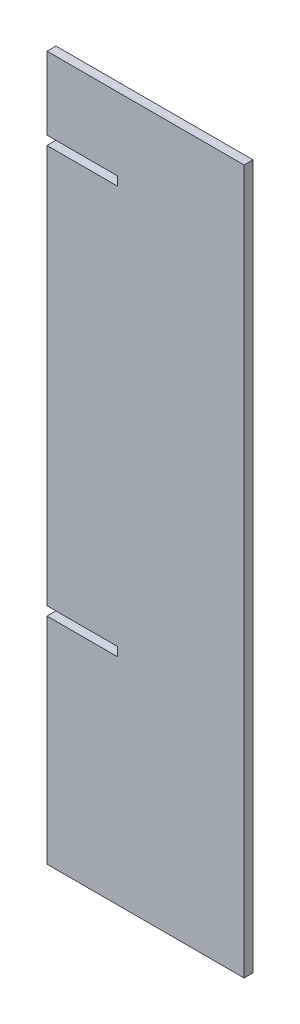
ISO-10303-21;
HEADER;
FILE_DESCRIPTION(('STEP AP214'),'2;1');
FILE_NAME('part.step','',(''),(''),'','','');
FILE_SCHEMA(('AUTOMOTIVE_DESIGN { 1 0 10303 214 1 1 1 1 }'));
ENDSEC;
DATA;
#1=APPLICATION_CONTEXT('core data for automotive mechanical design processes');
#2=APPLICATION_PROTOCOL_DEFINITION('international standard','automotive_design',2000,#1);
#3=PRODUCT_CONTEXT('',#1,'mechanical');
#4=PRODUCT('Part','Part','',(#3));
#5=PRODUCT_RELATED_PRODUCT_CATEGORY('part','',(#4));
#6=PRODUCT_DEFINITION_FORMATION('','',#4);
#7=PRODUCT_DEFINITION_CONTEXT('part definition',#1,'design');
#8=PRODUCT_DEFINITION('design','',#6,#7);
#9=PRODUCT_DEFINITION_SHAPE('','',#8);
#10=(LENGTH_UNIT() NAMED_UNIT(*) SI_UNIT(.MILLI.,.METRE.));
#11=(NAMED_UNIT(*) PLANE_ANGLE_UNIT() SI_UNIT($,.RADIAN.));
#12=(NAMED_UNIT(*) SI_UNIT($,.STERADIAN.) SOLID_ANGLE_UNIT());
#13=UNCERTAINTY_MEASURE_WITH_UNIT(LENGTH_MEASURE(1.E-05),#10,'distance_accuracy_value','');
#14=(GEOMETRIC_REPRESENTATION_CONTEXT(3) GLOBAL_UNCERTAINTY_ASSIGNED_CONTEXT((#13)) GLOBAL_UNIT_ASSIGNED_CONTEXT((#10,
#11,#12)) REPRESENTATION_CONTEXT('',''));
#15=CARTESIAN_POINT('',(0.,0.,0.));
#16=DIRECTION('',(0.,0.,1.));
#17=DIRECTION('',(1.,0.,0.));
#18=AXIS2_PLACEMENT_3D('',#15,#16,#17);
#19=CARTESIAN_POINT('',(-35.,125.,3.175));
#20=DIRECTION('',(1.,0.,0.));
#21=DIRECTION('',(0.,1.,0.));
#22=AXIS2_PLACEMENT_3D('',#19,#20,#21);
#23=PLANE('',#22);
#24=DIRECTION('',(0.,-1.,0.));
#25=VECTOR('',#24,1.);
#26=CARTESIAN_POINT('',(-35.,125.,0.));
#27=LINE('',#26,#25);
#28=CARTESIAN_POINT('',(-35.,125.,0.));
#29=VERTEX_POINT('',#28);
#30=CARTESIAN_POINT('',(-35.,99.18,0.));
#31=VERTEX_POINT('',#30);
#32=EDGE_CURVE('E152',#29,#31,#27,.T.);
#33=ORIENTED_EDGE('',*,*,#32,.T.);
#34=DIRECTION('',(0.,0.,1.));
#35=VECTOR('',#34,1.);
#36=CARTESIAN_POINT('',(-35.,99.18,0.));
#37=LINE('',#36,#35);
#38=CARTESIAN_POINT('',(-35.,99.18,3.175));
#39=VERTEX_POINT('',#38);
#40=EDGE_CURVE('E192',#31,#39,#37,.T.);
#41=ORIENTED_EDGE('',*,*,#40,.T.);
#42=DIRECTION('',(0.,-1.,0.));
#43=VECTOR('',#42,1.);
#44=CARTESIAN_POINT('',(-35.,125.,3.175));
#45=LINE('',#44,#43);
#46=CARTESIAN_POINT('',(-35.,125.,3.175));
#47=VERTEX_POINT('',#46);
#48=EDGE_CURVE('E176',#47,#39,#45,.T.);
#49=ORIENTED_EDGE('',*,*,#48,.F.);
#50=DIRECTION('',(0.,0.,-1.));
#51=VECTOR('',#50,1.);
#52=CARTESIAN_POINT('',(-35.,125.,3.175));
#53=LINE('',#52,#51);
#54=EDGE_CURVE('E47',#47,#29,#53,.T.);
#55=ORIENTED_EDGE('',*,*,#54,.T.);
#56=EDGE_LOOP('',(#33,#41,#49,#55));
#57=FACE_BOUND('',#56,.T.);
#58=ADVANCED_FACE('F39',(#57),#23,.F.);
#59=CARTESIAN_POINT('',(-35.,96.005,3.175));
#60=VERTEX_POINT('',#59);
#61=CARTESIAN_POINT('',(-35.,-45.52,3.175));
#62=VERTEX_POINT('',#61);
#63=EDGE_CURVE('E145',#60,#62,#45,.T.);
#64=ORIENTED_EDGE('',*,*,#63,.F.);
#65=DIRECTION('',(0.,0.,1.));
#66=VECTOR('',#65,1.);
#67=CARTESIAN_POINT('',(-35.,96.005,0.));
#68=LINE('',#67,#66);
#69=CARTESIAN_POINT('',(-35.,96.005,0.));
#70=VERTEX_POINT('',#69);
#71=EDGE_CURVE('E131',#70,#60,#68,.T.);
#72=ORIENTED_EDGE('',*,*,#71,.F.);
#73=CARTESIAN_POINT('',(-35.,-45.52,0.));
#74=VERTEX_POINT('',#73);
#75=EDGE_CURVE('E143',#70,#74,#27,.T.);
#76=ORIENTED_EDGE('',*,*,#75,.T.);
#77=DIRECTION('',(0.,0.,1.));
#78=VECTOR('',#77,1.);
#79=CARTESIAN_POINT('',(-35.,-45.52,0.));
#80=LINE('',#79,#78);
#81=EDGE_CURVE('E204',#74,#62,#80,.T.);
#82=ORIENTED_EDGE('',*,*,#81,.T.);
#83=EDGE_LOOP('',(#64,#72,#76,#82));
#84=FACE_BOUND('',#83,.T.);
#85=ADVANCED_FACE('F141',(#84),#23,.F.);
#86=CARTESIAN_POINT('',(35.,125.,3.175));
#87=DIRECTION('',(-1.,0.,0.));
#88=DIRECTION('',(0.,-1.,0.));
#89=AXIS2_PLACEMENT_3D('',#86,#87,#88);
#90=PLANE('',#89);
#91=DIRECTION('',(0.,1.,0.));
#92=VECTOR('',#91,1.);
#93=CARTESIAN_POINT('',(35.,125.,0.));
#94=LINE('',#93,#92);
#95=CARTESIAN_POINT('',(35.,-125.,0.));
#96=VERTEX_POINT('',#95);
#97=CARTESIAN_POINT('',(35.,125.,0.));
#98=VERTEX_POINT('',#97);
#99=EDGE_CURVE('E194',#96,#98,#94,.T.);
#100=ORIENTED_EDGE('',*,*,#99,.T.);
#101=DIRECTION('',(0.,0.,-1.));
#102=VECTOR('',#101,1.);
#103=CARTESIAN_POINT('',(35.,125.,3.175));
#104=LINE('',#103,#102);
#105=CARTESIAN_POINT('',(35.,125.,3.175));
#106=VERTEX_POINT('',#105);
#107=EDGE_CURVE('E11',#106,#98,#104,.T.);
#108=ORIENTED_EDGE('',*,*,#107,.F.);
#109=DIRECTION('',(0.,1.,0.));
#110=VECTOR('',#109,1.);
#111=CARTESIAN_POINT('',(35.,125.,3.175));
#112=LINE('',#111,#110);
#113=CARTESIAN_POINT('',(35.,-125.,3.175));
#114=VERTEX_POINT('',#113);
#115=EDGE_CURVE('E162',#114,#106,#112,.T.);
#116=ORIENTED_EDGE('',*,*,#115,.F.);
#117=DIRECTION('',(0.,0.,-1.));
#118=VECTOR('',#117,1.);
#119=CARTESIAN_POINT('',(35.,-125.,3.175));
#120=LINE('',#119,#118);
#121=EDGE_CURVE('E163',#114,#96,#120,.T.);
#122=ORIENTED_EDGE('',*,*,#121,.T.);
#123=EDGE_LOOP('',(#100,#108,#116,#122));
#124=FACE_BOUND('',#123,.T.);
#125=ADVANCED_FACE('F41',(#124),#90,.F.);
#126=CARTESIAN_POINT('',(-35.,125.,3.175));
#127=DIRECTION('',(0.,-1.,0.));
#128=DIRECTION('',(0.,0.,-1.));
#129=AXIS2_PLACEMENT_3D('',#126,#127,#128);
#130=PLANE('',#129);
#131=DIRECTION('',(-1.,0.,0.));
#132=VECTOR('',#131,1.);
#133=CARTESIAN_POINT('',(-35.,125.,0.));
#134=LINE('',#133,#132);
#135=EDGE_CURVE('E157',#98,#29,#134,.T.);
#136=ORIENTED_EDGE('',*,*,#135,.T.);
#137=ORIENTED_EDGE('',*,*,#54,.F.);
#138=DIRECTION('',(-1.,0.,0.));
#139=VECTOR('',#138,1.);
#140=CARTESIAN_POINT('',(-35.,125.,3.175));
#141=LINE('',#140,#139);
#142=EDGE_CURVE('E220',#106,#47,#141,.T.);
#143=ORIENTED_EDGE('',*,*,#142,.F.);
#144=ORIENTED_EDGE('',*,*,#107,.T.);
#145=EDGE_LOOP('',(#136,#137,#143,#144));
#146=FACE_BOUND('',#145,.T.);
#147=ADVANCED_FACE('F227',(#146),#130,.F.);
#148=CARTESIAN_POINT('',(-35.,-48.695,3.175));
#149=VERTEX_POINT('',#148);
#150=CARTESIAN_POINT('',(-35.,-125.,3.175));
#151=VERTEX_POINT('',#150);
#152=EDGE_CURVE('E222',#149,#151,#45,.T.);
#153=ORIENTED_EDGE('',*,*,#152,.F.);
#154=DIRECTION('',(0.,0.,1.));
#155=VECTOR('',#154,1.);
#156=CARTESIAN_POINT('',(-35.,-48.695,0.));
#157=LINE('',#156,#155);
#158=CARTESIAN_POINT('',(-35.,-48.695,0.));
#159=VERTEX_POINT('',#158);
#160=EDGE_CURVE('E198',#159,#149,#157,.T.);
#161=ORIENTED_EDGE('',*,*,#160,.F.);
#162=CARTESIAN_POINT('',(-35.,-125.,0.));
#163=VERTEX_POINT('',#162);
#164=EDGE_CURVE('E153',#159,#163,#27,.T.);
#165=ORIENTED_EDGE('',*,*,#164,.T.);
#166=DIRECTION('',(0.,0.,-1.));
#167=VECTOR('',#166,1.);
#168=CARTESIAN_POINT('',(-35.,-125.,3.175));
#169=LINE('',#168,#167);
#170=EDGE_CURVE('E166',#151,#163,#169,.T.);
#171=ORIENTED_EDGE('',*,*,#170,.F.);
#172=EDGE_LOOP('',(#153,#161,#165,#171));
#173=FACE_BOUND('',#172,.T.);
#174=ADVANCED_FACE('F243',(#173),#23,.F.);
#175=CARTESIAN_POINT('',(-35.,-125.,3.175));
#176=DIRECTION('',(0.,1.,0.));
#177=DIRECTION('',(0.,0.,1.));
#178=AXIS2_PLACEMENT_3D('',#175,#176,#177);
#179=PLANE('',#178);
#180=DIRECTION('',(1.,0.,0.));
#181=VECTOR('',#180,1.);
#182=CARTESIAN_POINT('',(-35.,-125.,0.));
#183=LINE('',#182,#181);
#184=EDGE_CURVE('E156',#163,#96,#183,.T.);
#185=ORIENTED_EDGE('',*,*,#184,.T.);
#186=ORIENTED_EDGE('',*,*,#121,.F.);
#187=DIRECTION('',(1.,0.,0.));
#188=VECTOR('',#187,1.);
#189=CARTESIAN_POINT('',(-35.,-125.,3.175));
#190=LINE('',#189,#188);
#191=EDGE_CURVE('E167',#151,#114,#190,.T.);
#192=ORIENTED_EDGE('',*,*,#191,.F.);
#193=ORIENTED_EDGE('',*,*,#170,.T.);
#194=EDGE_LOOP('',(#185,#186,#192,#193));
#195=FACE_BOUND('',#194,.T.);
#196=ADVANCED_FACE('F238',(#195),#179,.F.);
#197=CARTESIAN_POINT('',(0.,0.,3.175));
#198=DIRECTION('',(0.,0.,1.));
#199=DIRECTION('',(1.,0.,0.));
#200=AXIS2_PLACEMENT_3D('',#197,#198,#199);
#201=PLANE('',#200);
#202=DIRECTION('',(-1.,0.,0.));
#203=VECTOR('',#202,1.);
#204=CARTESIAN_POINT('',(-35.,99.18,3.175));
#205=LINE('',#204,#203);
#206=CARTESIAN_POINT('',(-10.,99.1800000000001,3.175));
#207=VERTEX_POINT('',#206);
#208=EDGE_CURVE('E136',#207,#39,#205,.T.);
#209=ORIENTED_EDGE('',*,*,#208,.F.);
#210=DIRECTION('',(0.,1.,0.));
#211=VECTOR('',#210,1.);
#212=CARTESIAN_POINT('',(-10.,99.1800000000001,3.175));
#213=LINE('',#212,#211);
#214=CARTESIAN_POINT('',(-10.,96.0050000000001,3.175));
#215=VERTEX_POINT('',#214);
#216=EDGE_CURVE('E187',#215,#207,#213,.T.);
#217=ORIENTED_EDGE('',*,*,#216,.F.);
#218=DIRECTION('',(1.,0.,0.));
#219=VECTOR('',#218,1.);
#220=CARTESIAN_POINT('',(-35.,96.005,3.175));
#221=LINE('',#220,#219);
#222=EDGE_CURVE('E185',#60,#215,#221,.T.);
#223=ORIENTED_EDGE('',*,*,#222,.F.);
#224=ORIENTED_EDGE('',*,*,#63,.T.);
#225=DIRECTION('',(-1.,0.,0.));
#226=VECTOR('',#225,1.);
#227=CARTESIAN_POINT('',(-35.,-45.52,3.175));
#228=LINE('',#227,#226);
#229=CARTESIAN_POINT('',(-10.,-45.52,3.175));
#230=VERTEX_POINT('',#229);
#231=EDGE_CURVE('E206',#230,#62,#228,.T.);
#232=ORIENTED_EDGE('',*,*,#231,.F.);
#233=DIRECTION('',(0.,1.,0.));
#234=VECTOR('',#233,1.);
#235=CARTESIAN_POINT('',(-10.,-45.52,3.175));
#236=LINE('',#235,#234);
#237=CARTESIAN_POINT('',(-10.,-48.695,3.175));
#238=VERTEX_POINT('',#237);
#239=EDGE_CURVE('E208',#238,#230,#236,.T.);
#240=ORIENTED_EDGE('',*,*,#239,.F.);
#241=DIRECTION('',(1.,0.,0.));
#242=VECTOR('',#241,1.);
#243=CARTESIAN_POINT('',(-35.,-48.695,3.175));
#244=LINE('',#243,#242);
#245=EDGE_CURVE('E188',#149,#238,#244,.T.);
#246=ORIENTED_EDGE('',*,*,#245,.F.);
#247=ORIENTED_EDGE('',*,*,#152,.T.);
#248=ORIENTED_EDGE('',*,*,#191,.T.);
#249=ORIENTED_EDGE('',*,*,#115,.T.);
#250=ORIENTED_EDGE('',*,*,#142,.T.);
#251=ORIENTED_EDGE('',*,*,#48,.T.);
#252=EDGE_LOOP('',(#209,#217,#223,#224,#232,#240,#246,#247,#248,#249,#250,#251));
#253=FACE_BOUND('',#252,.T.);
#254=ADVANCED_FACE('F232',(#253),#201,.T.);
#255=CARTESIAN_POINT('',(0.,0.,0.));
#256=DIRECTION('',(0.,0.,1.));
#257=DIRECTION('',(1.,0.,0.));
#258=AXIS2_PLACEMENT_3D('',#255,#256,#257);
#259=PLANE('',#258);
#260=DIRECTION('',(0.,1.,0.));
#261=VECTOR('',#260,1.);
#262=CARTESIAN_POINT('',(-10.,99.1800000000001,0.));
#263=LINE('',#262,#261);
#264=CARTESIAN_POINT('',(-10.,96.0050000000001,0.));
#265=VERTEX_POINT('',#264);
#266=CARTESIAN_POINT('',(-10.,99.1800000000001,0.));
#267=VERTEX_POINT('',#266);
#268=EDGE_CURVE('E54',#265,#267,#263,.T.);
#269=ORIENTED_EDGE('',*,*,#268,.T.);
#270=DIRECTION('',(-1.,0.,0.));
#271=VECTOR('',#270,1.);
#272=CARTESIAN_POINT('',(-35.,99.18,0.));
#273=LINE('',#272,#271);
#274=EDGE_CURVE('E146',#267,#31,#273,.T.);
#275=ORIENTED_EDGE('',*,*,#274,.T.);
#276=ORIENTED_EDGE('',*,*,#32,.F.);
#277=ORIENTED_EDGE('',*,*,#135,.F.);
#278=ORIENTED_EDGE('',*,*,#99,.F.);
#279=ORIENTED_EDGE('',*,*,#184,.F.);
#280=ORIENTED_EDGE('',*,*,#164,.F.);
#281=DIRECTION('',(1.,0.,0.));
#282=VECTOR('',#281,1.);
#283=CARTESIAN_POINT('',(-35.,-48.695,0.));
#284=LINE('',#283,#282);
#285=CARTESIAN_POINT('',(-10.,-48.695,0.));
#286=VERTEX_POINT('',#285);
#287=EDGE_CURVE('E209',#159,#286,#284,.T.);
#288=ORIENTED_EDGE('',*,*,#287,.T.);
#289=DIRECTION('',(0.,1.,0.));
#290=VECTOR('',#289,1.);
#291=CARTESIAN_POINT('',(-10.,-45.52,0.));
#292=LINE('',#291,#290);
#293=CARTESIAN_POINT('',(-10.,-45.52,0.));
#294=VERTEX_POINT('',#293);
#295=EDGE_CURVE('E62',#286,#294,#292,.T.);
#296=ORIENTED_EDGE('',*,*,#295,.T.);
#297=DIRECTION('',(-1.,0.,0.));
#298=VECTOR('',#297,1.);
#299=CARTESIAN_POINT('',(-35.,-45.52,0.));
#300=LINE('',#299,#298);
#301=EDGE_CURVE('E151',#294,#74,#300,.T.);
#302=ORIENTED_EDGE('',*,*,#301,.T.);
#303=ORIENTED_EDGE('',*,*,#75,.F.);
#304=DIRECTION('',(1.,0.,0.));
#305=VECTOR('',#304,1.);
#306=CARTESIAN_POINT('',(-35.,96.005,0.));
#307=LINE('',#306,#305);
#308=EDGE_CURVE('E127',#70,#265,#307,.T.);
#309=ORIENTED_EDGE('',*,*,#308,.T.);
#310=EDGE_LOOP('',(#269,#275,#276,#277,#278,#279,#280,#288,#296,#302,#303,#309));
#311=FACE_BOUND('',#310,.T.);
#312=ADVANCED_FACE('F149',(#311),#259,.F.);
#313=CARTESIAN_POINT('',(-35.,-45.52,0.));
#314=DIRECTION('',(0.,1.,0.));
#315=DIRECTION('',(-1.,0.,0.));
#316=AXIS2_PLACEMENT_3D('',#313,#314,#315);
#317=PLANE('',#316);
#318=ORIENTED_EDGE('',*,*,#231,.T.);
#319=ORIENTED_EDGE('',*,*,#81,.F.);
#320=ORIENTED_EDGE('',*,*,#301,.F.);
#321=DIRECTION('',(0.,0.,1.));
#322=VECTOR('',#321,1.);
#323=CARTESIAN_POINT('',(-10.,-45.52,0.));
#324=LINE('',#323,#322);
#325=EDGE_CURVE('E202',#294,#230,#324,.T.);
#326=ORIENTED_EDGE('',*,*,#325,.T.);
#327=EDGE_LOOP('',(#318,#319,#320,#326));
#328=FACE_BOUND('',#327,.T.);
#329=ADVANCED_FACE('F250',(#328),#317,.F.);
#330=CARTESIAN_POINT('',(-10.,-45.52,0.));
#331=DIRECTION('',(1.,0.,0.));
#332=DIRECTION('',(0.,1.,0.));
#333=AXIS2_PLACEMENT_3D('',#330,#331,#332);
#334=PLANE('',#333);
#335=ORIENTED_EDGE('',*,*,#239,.T.);
#336=ORIENTED_EDGE('',*,*,#325,.F.);
#337=ORIENTED_EDGE('',*,*,#295,.F.);
#338=DIRECTION('',(0.,0.,1.));
#339=VECTOR('',#338,1.);
#340=CARTESIAN_POINT('',(-10.,-48.695,0.));
#341=LINE('',#340,#339);
#342=EDGE_CURVE('E200',#286,#238,#341,.T.);
#343=ORIENTED_EDGE('',*,*,#342,.T.);
#344=EDGE_LOOP('',(#335,#336,#337,#343));
#345=FACE_BOUND('',#344,.T.);
#346=ADVANCED_FACE('F248',(#345),#334,.F.);
#347=CARTESIAN_POINT('',(-35.,-48.695,0.));
#348=DIRECTION('',(0.,-1.,0.));
#349=DIRECTION('',(1.,0.,0.));
#350=AXIS2_PLACEMENT_3D('',#347,#348,#349);
#351=PLANE('',#350);
#352=ORIENTED_EDGE('',*,*,#245,.T.);
#353=ORIENTED_EDGE('',*,*,#342,.F.);
#354=ORIENTED_EDGE('',*,*,#287,.F.);
#355=ORIENTED_EDGE('',*,*,#160,.T.);
#356=EDGE_LOOP('',(#352,#353,#354,#355));
#357=FACE_BOUND('',#356,.T.);
#358=ADVANCED_FACE('F245',(#357),#351,.F.);
#359=CARTESIAN_POINT('',(-35.,99.18,0.));
#360=DIRECTION('',(0.,1.,0.));
#361=DIRECTION('',(-1.,0.,0.));
#362=AXIS2_PLACEMENT_3D('',#359,#360,#361);
#363=PLANE('',#362);
#364=ORIENTED_EDGE('',*,*,#208,.T.);
#365=ORIENTED_EDGE('',*,*,#40,.F.);
#366=ORIENTED_EDGE('',*,*,#274,.F.);
#367=DIRECTION('',(0.,0.,1.));
#368=VECTOR('',#367,1.);
#369=CARTESIAN_POINT('',(-10.,99.1800000000001,0.));
#370=LINE('',#369,#368);
#371=EDGE_CURVE('E195',#267,#207,#370,.T.);
#372=ORIENTED_EDGE('',*,*,#371,.T.);
#373=EDGE_LOOP('',(#364,#365,#366,#372));
#374=FACE_BOUND('',#373,.T.);
#375=ADVANCED_FACE('F253',(#374),#363,.F.);
#376=CARTESIAN_POINT('',(-10.,99.1800000000001,0.));
#377=DIRECTION('',(1.,0.,0.));
#378=DIRECTION('',(0.,0.,-1.));
#379=AXIS2_PLACEMENT_3D('',#376,#377,#378);
#380=PLANE('',#379);
#381=ORIENTED_EDGE('',*,*,#216,.T.);
#382=ORIENTED_EDGE('',*,*,#371,.F.);
#383=ORIENTED_EDGE('',*,*,#268,.F.);
#384=DIRECTION('',(0.,0.,1.));
#385=VECTOR('',#384,1.);
#386=CARTESIAN_POINT('',(-10.,96.0050000000001,0.));
#387=LINE('',#386,#385);
#388=EDGE_CURVE('E133',#265,#215,#387,.T.);
#389=ORIENTED_EDGE('',*,*,#388,.T.);
#390=EDGE_LOOP('',(#381,#382,#383,#389));
#391=FACE_BOUND('',#390,.T.);
#392=ADVANCED_FACE('F252',(#391),#380,.F.);
#393=CARTESIAN_POINT('',(-35.,96.005,0.));
#394=DIRECTION('',(0.,-1.,0.));
#395=DIRECTION('',(1.,0.,0.));
#396=AXIS2_PLACEMENT_3D('',#393,#394,#395);
#397=PLANE('',#396);
#398=ORIENTED_EDGE('',*,*,#222,.T.);
#399=ORIENTED_EDGE('',*,*,#388,.F.);
#400=ORIENTED_EDGE('',*,*,#308,.F.);
#401=ORIENTED_EDGE('',*,*,#71,.T.);
#402=EDGE_LOOP('',(#398,#399,#400,#401));
#403=FACE_BOUND('',#402,.T.);
#404=ADVANCED_FACE('F130',(#403),#397,.F.);
#405=CLOSED_SHELL('',(#58,#85,#125,#147,#174,#196,#254,#312,#329,#346,#358,#375,#392,#404));
#406=MANIFOLD_SOLID_BREP('B2',#405);
#407=ADVANCED_BREP_SHAPE_REPRESENTATION('',(#18,#406),#14);
#408=SHAPE_DEFINITION_REPRESENTATION(#9,#407);
ENDSEC;
END-ISO-10303-21;
